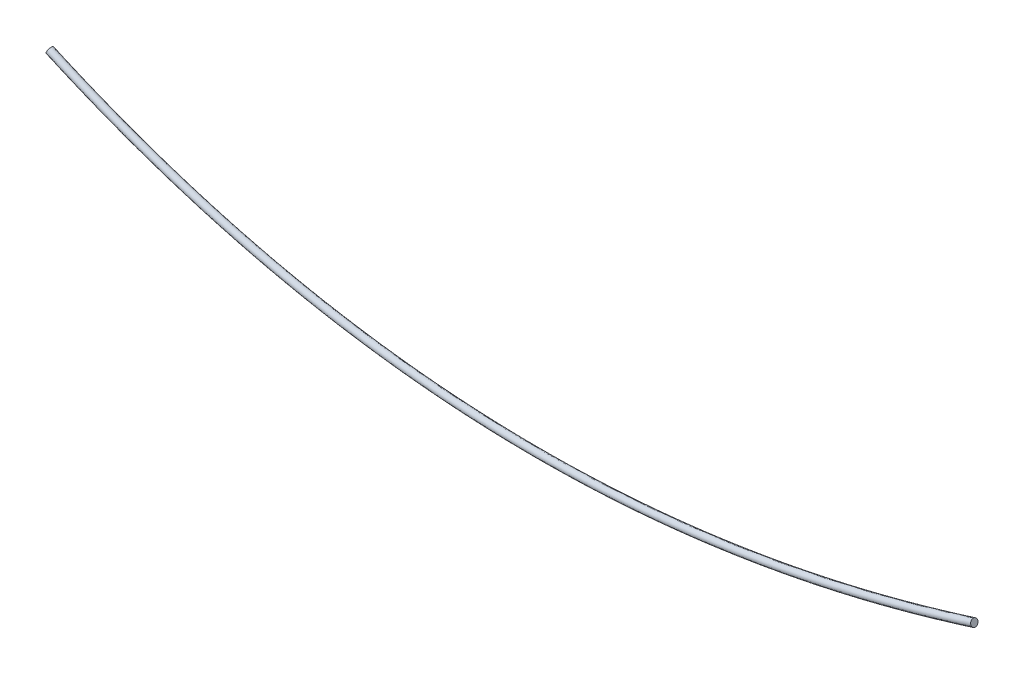
ISO-10303-21;
HEADER;
FILE_DESCRIPTION(('STEP AP214'),'2;1');
FILE_NAME('part.step','',(''),(''),'','','');
FILE_SCHEMA(('AUTOMOTIVE_DESIGN { 1 0 10303 214 1 1 1 1 }'));
ENDSEC;
DATA;
#1=APPLICATION_CONTEXT('core data for automotive mechanical design processes');
#2=APPLICATION_PROTOCOL_DEFINITION('international standard','automotive_design',2000,#1);
#3=PRODUCT_CONTEXT('',#1,'mechanical');
#4=PRODUCT('Part','Part','',(#3));
#5=PRODUCT_RELATED_PRODUCT_CATEGORY('part','',(#4));
#6=PRODUCT_DEFINITION_FORMATION('','',#4);
#7=PRODUCT_DEFINITION_CONTEXT('part definition',#1,'design');
#8=PRODUCT_DEFINITION('design','',#6,#7);
#9=PRODUCT_DEFINITION_SHAPE('','',#8);
#10=(LENGTH_UNIT() NAMED_UNIT(*) SI_UNIT(.MILLI.,.METRE.));
#11=(NAMED_UNIT(*) PLANE_ANGLE_UNIT() SI_UNIT($,.RADIAN.));
#12=(NAMED_UNIT(*) SI_UNIT($,.STERADIAN.) SOLID_ANGLE_UNIT());
#13=UNCERTAINTY_MEASURE_WITH_UNIT(LENGTH_MEASURE(1.E-05),#10,'distance_accuracy_value','');
#14=(GEOMETRIC_REPRESENTATION_CONTEXT(3) GLOBAL_UNCERTAINTY_ASSIGNED_CONTEXT((#13)) GLOBAL_UNIT_ASSIGNED_CONTEXT((#10,
#11,#12)) REPRESENTATION_CONTEXT('',''));
#15=CARTESIAN_POINT('',(0.,0.,0.));
#16=DIRECTION('',(0.,0.,1.));
#17=DIRECTION('',(1.,0.,0.));
#18=AXIS2_PLACEMENT_3D('',#15,#16,#17);
#19=CARTESIAN_POINT('',(-593.925909830064,-278.465511041299,0.));
#20=DIRECTION('',(0.912354701499646,-0.409400657854249,0.));
#21=DIRECTION('',(0.40940065785425,0.912354701499646,0.));
#22=AXIS2_PLACEMENT_3D('',#19,#20,#21);
#23=PLANE('',#22);
#24=CARTESIAN_POINT('',(-593.925909830064,-278.465511041299,0.));
#25=DIRECTION('',(0.912354701499646,-0.409400657854249,0.));
#26=DIRECTION('',(0.40940065785425,0.912354701499646,0.));
#27=AXIS2_PLACEMENT_3D('',#24,#25,#26);
#28=CIRCLE('',#27,5.);
#29=CARTESIAN_POINT('',(-591.878906540792,-273.903737533801,0.));
#30=VERTEX_POINT('',#29);
#31=EDGE_CURVE('E53',#30,#30,#28,.T.);
#32=ORIENTED_EDGE('',*,*,#31,.F.);
#33=EDGE_LOOP('',(#32));
#34=FACE_BOUND('',#33,.T.);
#35=ADVANCED_FACE('F45',(#34),#23,.F.);
#36=CARTESIAN_POINT('',(708.96142455461,-325.885511041299,0.));
#37=DIRECTION('',(0.953191078448819,0.302368596196062,0.));
#38=DIRECTION('',(-0.302368596196062,0.953191078448819,0.));
#39=AXIS2_PLACEMENT_3D('',#36,#37,#38);
#40=PLANE('',#39);
#41=CARTESIAN_POINT('',(708.96142455461,-325.885511041299,0.));
#42=DIRECTION('',(0.953191078448819,0.302368596196062,0.));
#43=DIRECTION('',(-0.302368596196062,0.953191078448819,0.));
#44=AXIS2_PLACEMENT_3D('',#41,#42,#43);
#45=CIRCLE('',#44,5.);
#46=CARTESIAN_POINT('',(707.44958157363,-321.119555649055,0.));
#47=VERTEX_POINT('',#46);
#48=EDGE_CURVE('E12',#47,#47,#45,.T.);
#49=ORIENTED_EDGE('',*,*,#48,.T.);
#50=EDGE_LOOP('',(#49));
#51=FACE_BOUND('',#50,.T.);
#52=ADVANCED_FACE('F60',(#51),#40,.T.);
#53=CARTESIAN_POINT('',(-591.878906540792,-273.903737533801,0.));
#54=CARTESIAN_POINT('',(-391.943618527551,-363.620640821025,0.));
#55=CARTESIAN_POINT('',(-183.786042290606,-412.399346188928,0.));
#56=CARTESIAN_POINT('',(249.243178026767,-428.159915119459,0.));
#57=CARTESIAN_POINT('',(474.128390296138,-395.133048443918,0.));
#58=CARTESIAN_POINT('',(707.44958157363,-321.119555649055,0.));
#59=CARTESIAN_POINT('',(-591.878906540792,-273.903737533801,10.));
#60=CARTESIAN_POINT('',(-391.943618527551,-363.620640821025,10.));
#61=CARTESIAN_POINT('',(-183.786042290606,-412.399346188928,10.));
#62=CARTESIAN_POINT('',(249.243178026767,-428.159915119459,10.));
#63=CARTESIAN_POINT('',(474.128390296138,-395.133048443918,10.));
#64=CARTESIAN_POINT('',(707.44958157363,-321.119555649055,10.));
#65=CARTESIAN_POINT('',(-595.972913119335,-283.027284548797,10.));
#66=CARTESIAN_POINT('',(-394.907155903892,-373.251462965463,10.));
#67=CARTESIAN_POINT('',(-185.416320137148,-422.346631642671,10.));
#68=CARTESIAN_POINT('',(250.146015796608,-438.19939606088,10.));
#69=CARTESIAN_POINT('',(476.203947925283,-404.965721814493,10.));
#70=CARTESIAN_POINT('',(710.47326753559,-330.651466433543,10.));
#71=CARTESIAN_POINT('',(-595.972913119335,-283.027284548797,0.));
#72=CARTESIAN_POINT('',(-394.907155903892,-373.251462965463,0.));
#73=CARTESIAN_POINT('',(-185.416320137148,-422.346631642671,0.));
#74=CARTESIAN_POINT('',(250.146015796608,-438.19939606088,0.));
#75=CARTESIAN_POINT('',(476.203947925283,-404.965721814493,0.));
#76=CARTESIAN_POINT('',(710.47326753559,-330.651466433543,0.));
#77=CARTESIAN_POINT('',(-595.972913119335,-283.027284548797,-10.));
#78=CARTESIAN_POINT('',(-394.907155903892,-373.251462965463,-10.));
#79=CARTESIAN_POINT('',(-185.416320137148,-422.346631642671,-10.));
#80=CARTESIAN_POINT('',(250.146015796608,-438.19939606088,-10.));
#81=CARTESIAN_POINT('',(476.203947925283,-404.965721814493,-10.));
#82=CARTESIAN_POINT('',(710.47326753559,-330.651466433543,-10.));
#83=CARTESIAN_POINT('',(-591.878906540792,-273.903737533801,-10.));
#84=CARTESIAN_POINT('',(-391.943618527551,-363.620640821025,-10.));
#85=CARTESIAN_POINT('',(-183.786042290606,-412.399346188928,-10.));
#86=CARTESIAN_POINT('',(249.243178026767,-428.159915119459,-10.));
#87=CARTESIAN_POINT('',(474.128390296138,-395.133048443918,-10.));
#88=CARTESIAN_POINT('',(707.44958157363,-321.119555649055,-10.));
#89=CARTESIAN_POINT('',(-591.878906540792,-273.903737533801,0.));
#90=CARTESIAN_POINT('',(-391.943618527551,-363.620640821025,0.));
#91=CARTESIAN_POINT('',(-183.786042290606,-412.399346188928,0.));
#92=CARTESIAN_POINT('',(249.243178026767,-428.159915119459,0.));
#93=CARTESIAN_POINT('',(474.128390296138,-395.133048443918,0.));
#94=CARTESIAN_POINT('',(707.44958157363,-321.119555649055,0.));
#95=(BOUNDED_SURFACE() B_SPLINE_SURFACE(3,3,((#53,#54,#55,#56,#57,#58),(#59,#60,#61,#62,#63,
#64),(#65,#66,#67,#68,#69,#70),(#71,#72,#73,#74,#75,#76),(#77,#78,#79,#80,#81,#82),(#83,#84,#85,
#86,#87,#88),(#89,#90,#91,#92,#93,#94)),.UNSPECIFIED.,.T.,.F.,
.F.) B_SPLINE_SURFACE_WITH_KNOTS((4,3,4),(4,2,4),(0.,0.5,1.),(0.,0.5,1.),
.UNSPECIFIED.) GEOMETRIC_REPRESENTATION_ITEM() RATIONAL_B_SPLINE_SURFACE(((1.,1.,1.,1.,1.,1.),
(0.333333333333333,0.333333333333333,0.333333333333333,0.333333333333333,0.333333333333333,
0.333333333333333),(0.333333333333333,0.333333333333333,0.333333333333333,0.333333333333333,
0.333333333333333,0.333333333333333),(1.,1.,1.,1.,1.,1.),(0.333333333333333,0.333333333333333,
0.333333333333333,0.333333333333333,0.333333333333333,0.333333333333333),(0.333333333333333,
0.333333333333333,0.333333333333333,0.333333333333333,0.333333333333333,0.333333333333333),(1.,
1.,1.,1.,1.,1.))) REPRESENTATION_ITEM('') SURFACE());
#96=ORIENTED_EDGE('',*,*,#48,.F.);
#97=EDGE_LOOP('',(#96));
#98=FACE_BOUND('',#97,.T.);
#99=ORIENTED_EDGE('',*,*,#31,.T.);
#100=EDGE_LOOP('',(#99));
#101=FACE_BOUND('',#100,.T.);
#102=ADVANCED_FACE('F62',(#98,#101),#95,.T.);
#103=CLOSED_SHELL('',(#35,#52,#102));
#104=MANIFOLD_SOLID_BREP('B2',#103);
#105=ADVANCED_BREP_SHAPE_REPRESENTATION('',(#18,#104),#14);
#106=SHAPE_DEFINITION_REPRESENTATION(#9,#105);
ENDSEC;
END-ISO-10303-21;
